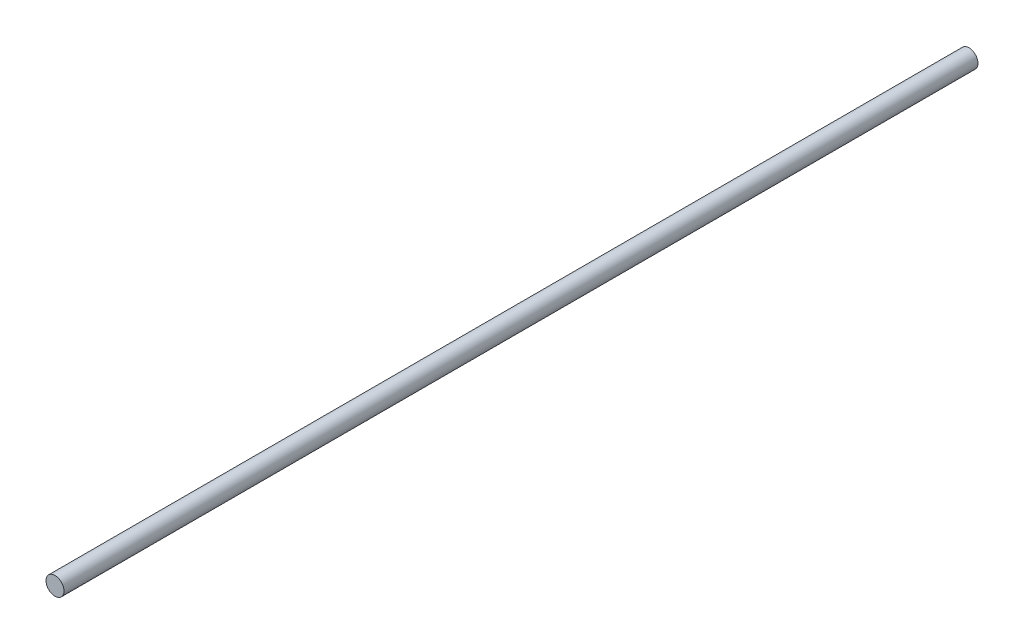
ISO-10303-21;
HEADER;
FILE_DESCRIPTION(('STEP AP214'),'2;1');
FILE_NAME('part.step','',(''),(''),'','','');
FILE_SCHEMA(('AUTOMOTIVE_DESIGN { 1 0 10303 214 1 1 1 1 }'));
ENDSEC;
DATA;
#1=APPLICATION_CONTEXT('core data for automotive mechanical design processes');
#2=APPLICATION_PROTOCOL_DEFINITION('international standard','automotive_design',2000,#1);
#3=PRODUCT_CONTEXT('',#1,'mechanical');
#4=PRODUCT('Part','Part','',(#3));
#5=PRODUCT_RELATED_PRODUCT_CATEGORY('part','',(#4));
#6=PRODUCT_DEFINITION_FORMATION('','',#4);
#7=PRODUCT_DEFINITION_CONTEXT('part definition',#1,'design');
#8=PRODUCT_DEFINITION('design','',#6,#7);
#9=PRODUCT_DEFINITION_SHAPE('','',#8);
#10=(LENGTH_UNIT() NAMED_UNIT(*) SI_UNIT(.MILLI.,.METRE.));
#11=(NAMED_UNIT(*) PLANE_ANGLE_UNIT() SI_UNIT($,.RADIAN.));
#12=(NAMED_UNIT(*) SI_UNIT($,.STERADIAN.) SOLID_ANGLE_UNIT());
#13=UNCERTAINTY_MEASURE_WITH_UNIT(LENGTH_MEASURE(1.E-05),#10,'distance_accuracy_value','');
#14=(GEOMETRIC_REPRESENTATION_CONTEXT(3) GLOBAL_UNCERTAINTY_ASSIGNED_CONTEXT((#13)) GLOBAL_UNIT_ASSIGNED_CONTEXT((#10,
#11,#12)) REPRESENTATION_CONTEXT('',''));
#15=CARTESIAN_POINT('',(0.,0.,0.));
#16=DIRECTION('',(0.,0.,1.));
#17=DIRECTION('',(1.,0.,0.));
#18=AXIS2_PLACEMENT_3D('',#15,#16,#17);
#19=CARTESIAN_POINT('',(0.,0.,72.9));
#20=DIRECTION('',(0.,0.,-1.));
#21=DIRECTION('',(-1.,0.,0.));
#22=AXIS2_PLACEMENT_3D('',#19,#20,#21);
#23=PLANE('',#22);
#24=CARTESIAN_POINT('',(0.,0.,72.9));
#25=DIRECTION('',(0.,0.,1.));
#26=DIRECTION('',(1.,0.,0.));
#27=AXIS2_PLACEMENT_3D('',#24,#25,#26);
#28=CIRCLE('',#27,4.);
#29=CARTESIAN_POINT('',(4.,0.,72.9));
#30=VERTEX_POINT('',#29);
#31=EDGE_CURVE('E10',#30,#30,#28,.T.);
#32=ORIENTED_EDGE('',*,*,#31,.T.);
#33=EDGE_LOOP('',(#32));
#34=FACE_BOUND('',#33,.T.);
#35=ADVANCED_FACE('F33',(#34),#23,.F.);
#36=CARTESIAN_POINT('',(0.,0.,72.9));
#37=DIRECTION('',(0.,0.,1.));
#38=DIRECTION('',(1.,0.,0.));
#39=AXIS2_PLACEMENT_3D('',#36,#37,#38);
#40=CYLINDRICAL_SURFACE('',#39,4.);
#41=ORIENTED_EDGE('',*,*,#31,.F.);
#42=EDGE_LOOP('',(#41));
#43=FACE_BOUND('',#42,.T.);
#44=CARTESIAN_POINT('',(0.,0.,-332.9));
#45=DIRECTION('',(0.,0.,1.));
#46=DIRECTION('',(1.,0.,0.));
#47=AXIS2_PLACEMENT_3D('',#44,#45,#46);
#48=CIRCLE('',#47,4.);
#49=CARTESIAN_POINT('',(4.,0.,-332.9));
#50=VERTEX_POINT('',#49);
#51=EDGE_CURVE('E39',#50,#50,#48,.T.);
#52=ORIENTED_EDGE('',*,*,#51,.T.);
#53=EDGE_LOOP('',(#52));
#54=FACE_BOUND('',#53,.T.);
#55=ADVANCED_FACE('F45',(#43,#54),#40,.T.);
#56=CARTESIAN_POINT('',(0.,0.,-332.9));
#57=DIRECTION('',(0.,0.,1.));
#58=DIRECTION('',(1.,0.,0.));
#59=AXIS2_PLACEMENT_3D('',#56,#57,#58);
#60=PLANE('',#59);
#61=ORIENTED_EDGE('',*,*,#51,.F.);
#62=EDGE_LOOP('',(#61));
#63=FACE_BOUND('',#62,.T.);
#64=ADVANCED_FACE('F47',(#63),#60,.F.);
#65=CLOSED_SHELL('',(#35,#55,#64));
#66=MANIFOLD_SOLID_BREP('B2',#65);
#67=ADVANCED_BREP_SHAPE_REPRESENTATION('',(#18,#66),#14);
#68=SHAPE_DEFINITION_REPRESENTATION(#9,#67);
ENDSEC;
END-ISO-10303-21;
